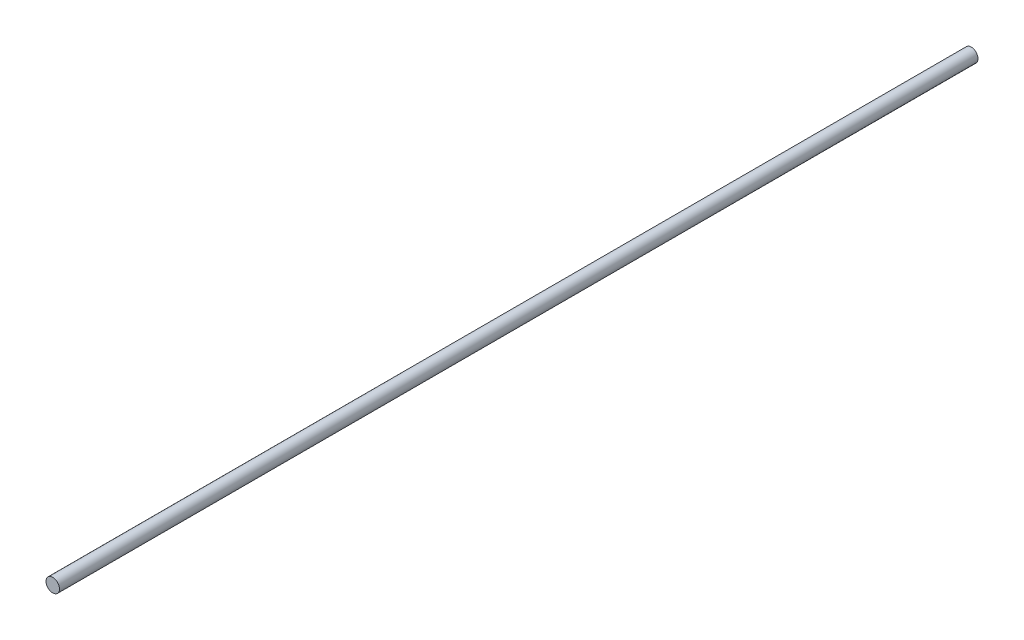
ISO-10303-21;
HEADER;
FILE_DESCRIPTION(('STEP AP214'),'2;1');
FILE_NAME('part.step','',(''),(''),'','','');
FILE_SCHEMA(('AUTOMOTIVE_DESIGN { 1 0 10303 214 1 1 1 1 }'));
ENDSEC;
DATA;
#1=APPLICATION_CONTEXT('core data for automotive mechanical design processes');
#2=APPLICATION_PROTOCOL_DEFINITION('international standard','automotive_design',2000,#1);
#3=PRODUCT_CONTEXT('',#1,'mechanical');
#4=PRODUCT('Part','Part','',(#3));
#5=PRODUCT_RELATED_PRODUCT_CATEGORY('part','',(#4));
#6=PRODUCT_DEFINITION_FORMATION('','',#4);
#7=PRODUCT_DEFINITION_CONTEXT('part definition',#1,'design');
#8=PRODUCT_DEFINITION('design','',#6,#7);
#9=PRODUCT_DEFINITION_SHAPE('','',#8);
#10=(LENGTH_UNIT() NAMED_UNIT(*) SI_UNIT(.MILLI.,.METRE.));
#11=(NAMED_UNIT(*) PLANE_ANGLE_UNIT() SI_UNIT($,.RADIAN.));
#12=(NAMED_UNIT(*) SI_UNIT($,.STERADIAN.) SOLID_ANGLE_UNIT());
#13=UNCERTAINTY_MEASURE_WITH_UNIT(LENGTH_MEASURE(1.E-05),#10,'distance_accuracy_value','');
#14=(GEOMETRIC_REPRESENTATION_CONTEXT(3) GLOBAL_UNCERTAINTY_ASSIGNED_CONTEXT((#13)) GLOBAL_UNIT_ASSIGNED_CONTEXT((#10,
#11,#12)) REPRESENTATION_CONTEXT('',''));
#15=CARTESIAN_POINT('',(0.,0.,0.));
#16=DIRECTION('',(0.,0.,1.));
#17=DIRECTION('',(1.,0.,0.));
#18=AXIS2_PLACEMENT_3D('',#15,#16,#17);
#19=CARTESIAN_POINT('',(0.,0.,43.18));
#20=DIRECTION('',(0.,0.,-1.));
#21=DIRECTION('',(-1.,0.,0.));
#22=AXIS2_PLACEMENT_3D('',#19,#20,#21);
#23=CYLINDRICAL_SURFACE('',#22,0.317499999999998);
#24=CARTESIAN_POINT('',(0.,0.,43.18));
#25=DIRECTION('',(0.,0.,1.));
#26=DIRECTION('',(1.,0.,0.));
#27=AXIS2_PLACEMENT_3D('',#24,#25,#26);
#28=CIRCLE('',#27,0.317499999999998);
#29=CARTESIAN_POINT('',(0.317499999999998,0.,43.18));
#30=VERTEX_POINT('',#29);
#31=EDGE_CURVE('E10',#30,#30,#28,.T.);
#32=ORIENTED_EDGE('',*,*,#31,.F.);
#33=EDGE_LOOP('',(#32));
#34=FACE_BOUND('',#33,.T.);
#35=CARTESIAN_POINT('',(0.,0.,0.));
#36=DIRECTION('',(0.,0.,1.));
#37=DIRECTION('',(1.,0.,0.));
#38=AXIS2_PLACEMENT_3D('',#35,#36,#37);
#39=CIRCLE('',#38,0.317499999999998);
#40=CARTESIAN_POINT('',(0.317499999999998,0.,0.));
#41=VERTEX_POINT('',#40);
#42=EDGE_CURVE('E36',#41,#41,#39,.T.);
#43=ORIENTED_EDGE('',*,*,#42,.T.);
#44=EDGE_LOOP('',(#43));
#45=FACE_BOUND('',#44,.T.);
#46=ADVANCED_FACE('F33',(#34,#45),#23,.T.);
#47=CARTESIAN_POINT('',(0.,0.,43.18));
#48=DIRECTION('',(0.,0.,1.));
#49=DIRECTION('',(1.,0.,0.));
#50=AXIS2_PLACEMENT_3D('',#47,#48,#49);
#51=PLANE('',#50);
#52=ORIENTED_EDGE('',*,*,#31,.T.);
#53=EDGE_LOOP('',(#52));
#54=FACE_BOUND('',#53,.T.);
#55=ADVANCED_FACE('F48',(#54),#51,.T.);
#56=CARTESIAN_POINT('',(0.,0.,0.));
#57=DIRECTION('',(0.,0.,1.));
#58=DIRECTION('',(1.,0.,0.));
#59=AXIS2_PLACEMENT_3D('',#56,#57,#58);
#60=PLANE('',#59);
#61=ORIENTED_EDGE('',*,*,#42,.F.);
#62=EDGE_LOOP('',(#61));
#63=FACE_BOUND('',#62,.T.);
#64=ADVANCED_FACE('F46',(#63),#60,.F.);
#65=CLOSED_SHELL('',(#46,#55,#64));
#66=MANIFOLD_SOLID_BREP('B2',#65);
#67=ADVANCED_BREP_SHAPE_REPRESENTATION('',(#18,#66),#14);
#68=SHAPE_DEFINITION_REPRESENTATION(#9,#67);
ENDSEC;
END-ISO-10303-21;
